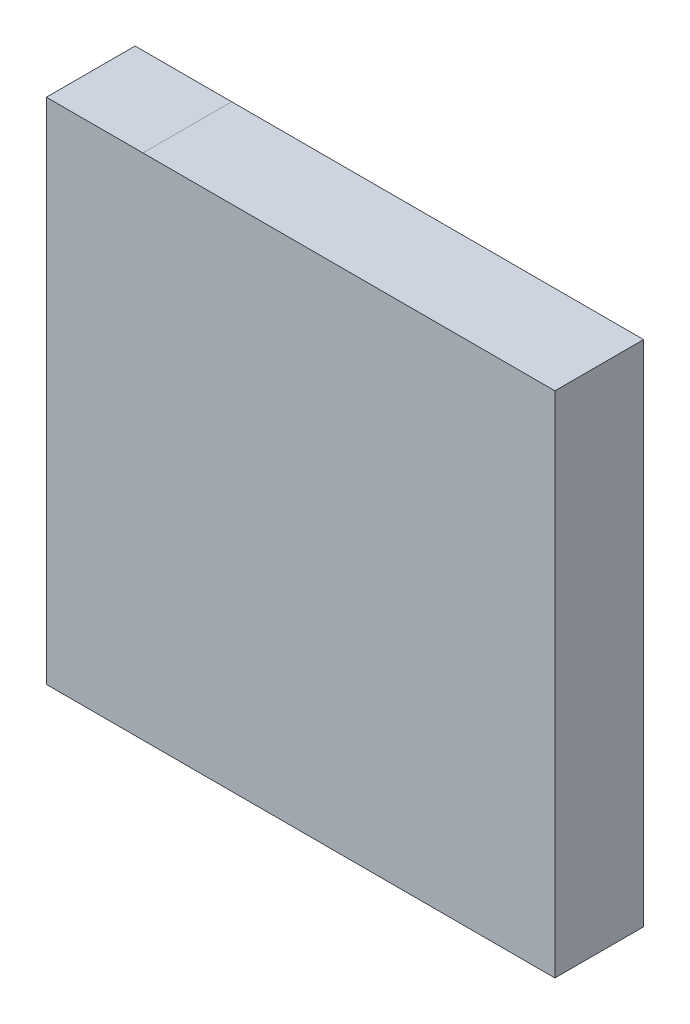
ISO-10303-21;
HEADER;
FILE_DESCRIPTION(('STEP AP214'),'2;1');
FILE_NAME('part.step','',(''),(''),'','','');
FILE_SCHEMA(('AUTOMOTIVE_DESIGN { 1 0 10303 214 1 1 1 1 }'));
ENDSEC;
DATA;
#1=APPLICATION_CONTEXT('core data for automotive mechanical design processes');
#2=APPLICATION_PROTOCOL_DEFINITION('international standard','automotive_design',2000,#1);
#3=PRODUCT_CONTEXT('',#1,'mechanical');
#4=PRODUCT('Part','Part','',(#3));
#5=PRODUCT_RELATED_PRODUCT_CATEGORY('part','',(#4));
#6=PRODUCT_DEFINITION_FORMATION('','',#4);
#7=PRODUCT_DEFINITION_CONTEXT('part definition',#1,'design');
#8=PRODUCT_DEFINITION('design','',#6,#7);
#9=PRODUCT_DEFINITION_SHAPE('','',#8);
#10=(LENGTH_UNIT() NAMED_UNIT(*) SI_UNIT(.MILLI.,.METRE.));
#11=(NAMED_UNIT(*) PLANE_ANGLE_UNIT() SI_UNIT($,.RADIAN.));
#12=(NAMED_UNIT(*) SI_UNIT($,.STERADIAN.) SOLID_ANGLE_UNIT());
#13=UNCERTAINTY_MEASURE_WITH_UNIT(LENGTH_MEASURE(1.E-05),#10,'distance_accuracy_value','');
#14=(GEOMETRIC_REPRESENTATION_CONTEXT(3) GLOBAL_UNCERTAINTY_ASSIGNED_CONTEXT((#13)) GLOBAL_UNIT_ASSIGNED_CONTEXT((#10,
#11,#12)) REPRESENTATION_CONTEXT('',''));
#15=CARTESIAN_POINT('',(0.,0.,0.));
#16=DIRECTION('',(0.,0.,1.));
#17=DIRECTION('',(1.,0.,0.));
#18=AXIS2_PLACEMENT_3D('',#15,#16,#17);
#19=CARTESIAN_POINT('',(2.0066,2.0066,0.70000114));
#20=DIRECTION('',(0.,0.,1.));
#21=DIRECTION('',(1.,0.,0.));
#22=AXIS2_PLACEMENT_3D('',#19,#20,#21);
#23=PLANE('',#22);
#24=DIRECTION('',(1.,0.,0.));
#25=VECTOR('',#24,1.);
#26=CARTESIAN_POINT('',(2.0066,-2.0066,0.70000114));
#27=LINE('',#26,#25);
#28=CARTESIAN_POINT('',(2.0066,-2.0066,0.70000114));
#29=VERTEX_POINT('',#28);
#30=CARTESIAN_POINT('',(-2.0066,-2.0066,0.70000114));
#31=VERTEX_POINT('',#30);
#32=EDGE_CURVE('E97',#29,#31,#27,.F.);
#33=ORIENTED_EDGE('',*,*,#32,.F.);
#34=DIRECTION('',(0.,1.,0.));
#35=VECTOR('',#34,1.);
#36=CARTESIAN_POINT('',(2.0066,2.0066,0.70000114));
#37=LINE('',#36,#35);
#38=CARTESIAN_POINT('',(2.0066,2.0066,0.70000114));
#39=VERTEX_POINT('',#38);
#40=EDGE_CURVE('E82',#39,#29,#37,.F.);
#41=ORIENTED_EDGE('',*,*,#40,.F.);
#42=DIRECTION('',(1.,0.,0.));
#43=VECTOR('',#42,1.);
#44=CARTESIAN_POINT('',(-1.2446,2.0066,0.70000114));
#45=LINE('',#44,#43);
#46=CARTESIAN_POINT('',(-1.24460001216463,2.00659999999982,0.70000114));
#47=VERTEX_POINT('',#46);
#48=EDGE_CURVE('E20',#47,#39,#45,.T.);
#49=ORIENTED_EDGE('',*,*,#48,.F.);
#50=DIRECTION('',(-0.999999999549973,-3.00009000153392E-05,0.));
#51=VECTOR('',#50,1.);
#52=CARTESIAN_POINT('',(-2.00657714,2.00657714,0.70000114));
#53=LINE('',#52,#51);
#54=CARTESIAN_POINT('',(-2.00657714,2.00657714,0.70000114));
#55=VERTEX_POINT('',#54);
#56=EDGE_CURVE('E71',#55,#47,#53,.F.);
#57=ORIENTED_EDGE('',*,*,#56,.F.);
#58=DIRECTION('',(-3.00009000153392E-05,-0.999999999549973,0.));
#59=VECTOR('',#58,1.);
#60=CARTESIAN_POINT('',(-2.0066,1.2446,0.70000114));
#61=LINE('',#60,#59);
#62=CARTESIAN_POINT('',(-2.0066,1.24460000000043,0.70000114));
#63=VERTEX_POINT('',#62);
#64=EDGE_CURVE('E66',#63,#55,#61,.F.);
#65=ORIENTED_EDGE('',*,*,#64,.F.);
#66=DIRECTION('',(0.,1.,0.));
#67=VECTOR('',#66,1.);
#68=CARTESIAN_POINT('',(-2.0066,-2.0066,0.70000114));
#69=LINE('',#68,#67);
#70=EDGE_CURVE('E93',#31,#63,#69,.T.);
#71=ORIENTED_EDGE('',*,*,#70,.F.);
#72=EDGE_LOOP('',(#33,#41,#49,#57,#65,#71));
#73=FACE_BOUND('',#72,.T.);
#74=ADVANCED_FACE('F17',(#73),#23,.T.);
#75=CARTESIAN_POINT('',(-1.2446,2.0066,0.));
#76=DIRECTION('',(0.,1.,0.));
#77=DIRECTION('',(0.,0.,1.));
#78=AXIS2_PLACEMENT_3D('',#75,#76,#77);
#79=PLANE('',#78);
#80=DIRECTION('',(0.,0.,-1.));
#81=VECTOR('',#80,1.);
#82=CARTESIAN_POINT('',(2.0066,2.0066,0.));
#83=LINE('',#82,#81);
#84=CARTESIAN_POINT('',(2.0066,2.0066,0.));
#85=VERTEX_POINT('',#84);
#86=EDGE_CURVE('E101',#85,#39,#83,.F.);
#87=ORIENTED_EDGE('',*,*,#86,.F.);
#88=DIRECTION('',(1.,0.,0.));
#89=VECTOR('',#88,1.);
#90=CARTESIAN_POINT('',(2.0066,2.0066,0.));
#91=LINE('',#90,#89);
#92=CARTESIAN_POINT('',(-1.24460000608231,2.00659999999991,0.));
#93=VERTEX_POINT('',#92);
#94=EDGE_CURVE('E88',#85,#93,#91,.F.);
#95=ORIENTED_EDGE('',*,*,#94,.T.);
#96=DIRECTION('',(0.,0.,1.));
#97=VECTOR('',#96,1.);
#98=CARTESIAN_POINT('',(-1.2446,2.0066,0.));
#99=LINE('',#98,#97);
#100=EDGE_CURVE('E76',#47,#93,#99,.F.);
#101=ORIENTED_EDGE('',*,*,#100,.F.);
#102=ORIENTED_EDGE('',*,*,#48,.T.);
#103=EDGE_LOOP('',(#87,#95,#101,#102));
#104=FACE_BOUND('',#103,.T.);
#105=ADVANCED_FACE('F87',(#104),#79,.T.);
#106=CARTESIAN_POINT('',(-2.00657714,2.00657714,0.));
#107=DIRECTION('',(-3.00009000153392E-05,0.999999999549973,0.));
#108=DIRECTION('',(-0.999999999549973,-3.00009000153392E-05,0.));
#109=AXIS2_PLACEMENT_3D('',#106,#107,#108);
#110=PLANE('',#109);
#111=ORIENTED_EDGE('',*,*,#100,.T.);
#112=DIRECTION('',(-0.999999999549973,-3.0000900013713E-05,0.));
#113=VECTOR('',#112,1.);
#114=CARTESIAN_POINT('',(-1.2446,2.0066,0.));
#115=LINE('',#114,#113);
#116=CARTESIAN_POINT('',(-2.00657714,2.00657714,0.));
#117=VERTEX_POINT('',#116);
#118=EDGE_CURVE('E106',#93,#117,#115,.T.);
#119=ORIENTED_EDGE('',*,*,#118,.T.);
#120=DIRECTION('',(0.,0.,1.));
#121=VECTOR('',#120,1.);
#122=CARTESIAN_POINT('',(-2.00657714,2.00657714,0.));
#123=LINE('',#122,#121);
#124=EDGE_CURVE('E78',#55,#117,#123,.F.);
#125=ORIENTED_EDGE('',*,*,#124,.F.);
#126=ORIENTED_EDGE('',*,*,#56,.T.);
#127=EDGE_LOOP('',(#111,#119,#125,#126));
#128=FACE_BOUND('',#127,.T.);
#129=ADVANCED_FACE('F73',(#128),#110,.T.);
#130=CARTESIAN_POINT('',(-2.0066,1.2446,0.));
#131=DIRECTION('',(-0.999999999549973,3.00009000153392E-05,0.));
#132=DIRECTION('',(-3.00009000153392E-05,-0.999999999549973,0.));
#133=AXIS2_PLACEMENT_3D('',#130,#131,#132);
#134=PLANE('',#133);
#135=ORIENTED_EDGE('',*,*,#124,.T.);
#136=DIRECTION('',(-3.00009000131438E-05,-0.999999999549973,0.));
#137=VECTOR('',#136,1.);
#138=CARTESIAN_POINT('',(-2.00657714,2.00657714,0.));
#139=LINE('',#138,#137);
#140=CARTESIAN_POINT('',(-2.0066,1.24460000000022,0.));
#141=VERTEX_POINT('',#140);
#142=EDGE_CURVE('E108',#117,#141,#139,.T.);
#143=ORIENTED_EDGE('',*,*,#142,.T.);
#144=DIRECTION('',(0.,0.,1.));
#145=VECTOR('',#144,1.);
#146=CARTESIAN_POINT('',(-2.0066,1.2446,0.));
#147=LINE('',#146,#145);
#148=EDGE_CURVE('E95',#63,#141,#147,.F.);
#149=ORIENTED_EDGE('',*,*,#148,.F.);
#150=ORIENTED_EDGE('',*,*,#64,.T.);
#151=EDGE_LOOP('',(#135,#143,#149,#150));
#152=FACE_BOUND('',#151,.T.);
#153=ADVANCED_FACE('F126',(#152),#134,.T.);
#154=CARTESIAN_POINT('',(-2.0066,-2.0066,0.));
#155=DIRECTION('',(-1.,0.,0.));
#156=DIRECTION('',(0.,0.,1.));
#157=AXIS2_PLACEMENT_3D('',#154,#155,#156);
#158=PLANE('',#157);
#159=ORIENTED_EDGE('',*,*,#148,.T.);
#160=DIRECTION('',(0.,1.,0.));
#161=VECTOR('',#160,1.);
#162=CARTESIAN_POINT('',(-2.0066,2.0066,0.));
#163=LINE('',#162,#161);
#164=CARTESIAN_POINT('',(-2.0066,-2.0066,0.));
#165=VERTEX_POINT('',#164);
#166=EDGE_CURVE('E111',#141,#165,#163,.F.);
#167=ORIENTED_EDGE('',*,*,#166,.T.);
#168=DIRECTION('',(0.,0.,-1.));
#169=VECTOR('',#168,1.);
#170=CARTESIAN_POINT('',(-2.0066,-2.0066,0.));
#171=LINE('',#170,#169);
#172=EDGE_CURVE('E99',#31,#165,#171,.T.);
#173=ORIENTED_EDGE('',*,*,#172,.F.);
#174=ORIENTED_EDGE('',*,*,#70,.T.);
#175=EDGE_LOOP('',(#159,#167,#173,#174));
#176=FACE_BOUND('',#175,.T.);
#177=ADVANCED_FACE('F124',(#176),#158,.T.);
#178=CARTESIAN_POINT('',(2.0066,-2.0066,0.));
#179=DIRECTION('',(0.,-1.,0.));
#180=DIRECTION('',(0.,0.,-1.));
#181=AXIS2_PLACEMENT_3D('',#178,#179,#180);
#182=PLANE('',#181);
#183=ORIENTED_EDGE('',*,*,#172,.T.);
#184=DIRECTION('',(1.,0.,0.));
#185=VECTOR('',#184,1.);
#186=CARTESIAN_POINT('',(2.0066,-2.0066,0.));
#187=LINE('',#186,#185);
#188=CARTESIAN_POINT('',(2.0066,-2.0066,0.));
#189=VERTEX_POINT('',#188);
#190=EDGE_CURVE('E26',#165,#189,#187,.T.);
#191=ORIENTED_EDGE('',*,*,#190,.T.);
#192=DIRECTION('',(0.,0.,-1.));
#193=VECTOR('',#192,1.);
#194=CARTESIAN_POINT('',(2.0066,-2.0066,0.));
#195=LINE('',#194,#193);
#196=EDGE_CURVE('E34',#29,#189,#195,.T.);
#197=ORIENTED_EDGE('',*,*,#196,.F.);
#198=ORIENTED_EDGE('',*,*,#32,.T.);
#199=EDGE_LOOP('',(#183,#191,#197,#198));
#200=FACE_BOUND('',#199,.T.);
#201=ADVANCED_FACE('F117',(#200),#182,.T.);
#202=CARTESIAN_POINT('',(2.0066,2.0066,0.));
#203=DIRECTION('',(1.,0.,0.));
#204=DIRECTION('',(0.,0.,-1.));
#205=AXIS2_PLACEMENT_3D('',#202,#203,#204);
#206=PLANE('',#205);
#207=ORIENTED_EDGE('',*,*,#196,.T.);
#208=DIRECTION('',(0.,1.,0.));
#209=VECTOR('',#208,1.);
#210=CARTESIAN_POINT('',(2.0066,2.0066,0.));
#211=LINE('',#210,#209);
#212=EDGE_CURVE('E11',#189,#85,#211,.T.);
#213=ORIENTED_EDGE('',*,*,#212,.T.);
#214=ORIENTED_EDGE('',*,*,#86,.T.);
#215=ORIENTED_EDGE('',*,*,#40,.T.);
#216=EDGE_LOOP('',(#207,#213,#214,#215));
#217=FACE_BOUND('',#216,.T.);
#218=ADVANCED_FACE('F127',(#217),#206,.T.);
#219=CARTESIAN_POINT('',(2.0066,2.0066,0.));
#220=DIRECTION('',(0.,0.,1.));
#221=DIRECTION('',(1.,0.,0.));
#222=AXIS2_PLACEMENT_3D('',#219,#220,#221);
#223=PLANE('',#222);
#224=ORIENTED_EDGE('',*,*,#190,.F.);
#225=ORIENTED_EDGE('',*,*,#166,.F.);
#226=ORIENTED_EDGE('',*,*,#142,.F.);
#227=ORIENTED_EDGE('',*,*,#118,.F.);
#228=ORIENTED_EDGE('',*,*,#94,.F.);
#229=ORIENTED_EDGE('',*,*,#212,.F.);
#230=EDGE_LOOP('',(#224,#225,#226,#227,#228,#229));
#231=FACE_BOUND('',#230,.T.);
#232=ADVANCED_FACE('F121',(#231),#223,.F.);
#233=CLOSED_SHELL('',(#74,#105,#129,#153,#177,#201,#218,#232));
#234=MANIFOLD_SOLID_BREP('B1',#233);
#235=ADVANCED_BREP_SHAPE_REPRESENTATION('',(#18,#234),#14);
#236=SHAPE_DEFINITION_REPRESENTATION(#9,#235);
ENDSEC;
END-ISO-10303-21;
